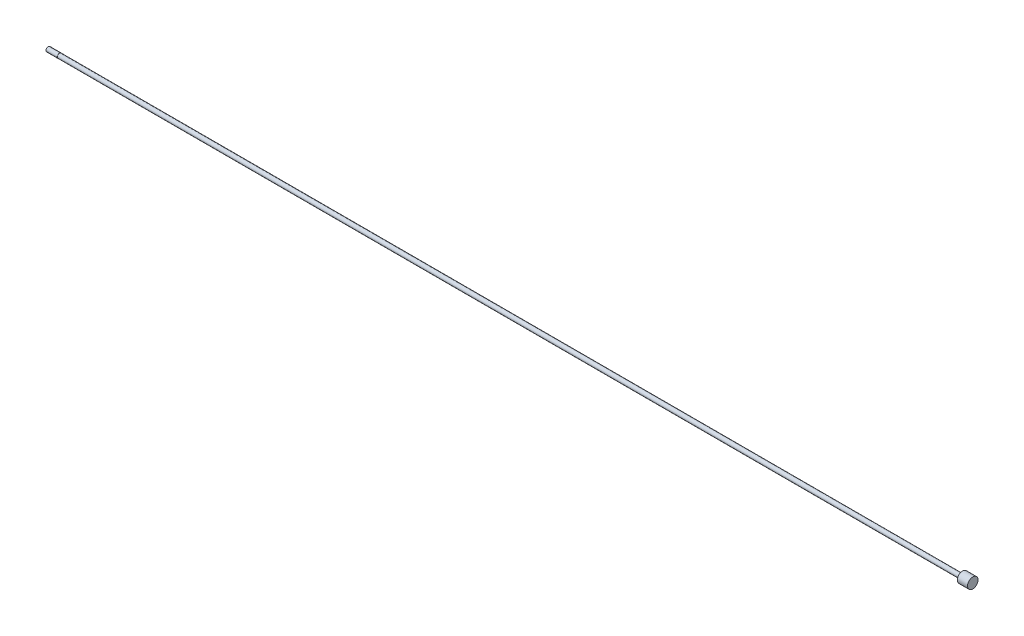
ISO-10303-21;
HEADER;
FILE_DESCRIPTION(('STEP AP214'),'2;1');
FILE_NAME('part.step','',(''),(''),'','','');
FILE_SCHEMA(('AUTOMOTIVE_DESIGN { 1 0 10303 214 1 1 1 1 }'));
ENDSEC;
DATA;
#1=APPLICATION_CONTEXT('core data for automotive mechanical design processes');
#2=APPLICATION_PROTOCOL_DEFINITION('international standard','automotive_design',2000,#1);
#3=PRODUCT_CONTEXT('',#1,'mechanical');
#4=PRODUCT('Part','Part','',(#3));
#5=PRODUCT_RELATED_PRODUCT_CATEGORY('part','',(#4));
#6=PRODUCT_DEFINITION_FORMATION('','',#4);
#7=PRODUCT_DEFINITION_CONTEXT('part definition',#1,'design');
#8=PRODUCT_DEFINITION('design','',#6,#7);
#9=PRODUCT_DEFINITION_SHAPE('','',#8);
#10=(LENGTH_UNIT() NAMED_UNIT(*) SI_UNIT(.MILLI.,.METRE.));
#11=(NAMED_UNIT(*) PLANE_ANGLE_UNIT() SI_UNIT($,.RADIAN.));
#12=(NAMED_UNIT(*) SI_UNIT($,.STERADIAN.) SOLID_ANGLE_UNIT());
#13=UNCERTAINTY_MEASURE_WITH_UNIT(LENGTH_MEASURE(1.E-05),#10,'distance_accuracy_value','');
#14=(GEOMETRIC_REPRESENTATION_CONTEXT(3) GLOBAL_UNCERTAINTY_ASSIGNED_CONTEXT((#13)) GLOBAL_UNIT_ASSIGNED_CONTEXT((#10,
#11,#12)) REPRESENTATION_CONTEXT('',''));
#15=CARTESIAN_POINT('',(0.,0.,0.));
#16=DIRECTION('',(0.,0.,1.));
#17=DIRECTION('',(1.,0.,0.));
#18=AXIS2_PLACEMENT_3D('',#15,#16,#17);
#19=CARTESIAN_POINT('',(980.9988,0.,0.));
#20=DIRECTION('',(-1.,0.,0.));
#21=DIRECTION('',(0.,0.,1.));
#22=AXIS2_PLACEMENT_3D('',#19,#20,#21);
#23=CYLINDRICAL_SURFACE('',#22,2.3749);
#24=CARTESIAN_POINT('',(0.,0.,0.));
#25=DIRECTION('',(-1.,0.,0.));
#26=DIRECTION('',(0.,0.,1.));
#27=AXIS2_PLACEMENT_3D('',#24,#25,#26);
#28=CIRCLE('',#27,2.3749);
#29=CARTESIAN_POINT('',(0.,0.,2.3749));
#30=VERTEX_POINT('',#29);
#31=EDGE_CURVE('E56',#30,#30,#28,.T.);
#32=ORIENTED_EDGE('',*,*,#31,.F.);
#33=EDGE_LOOP('',(#32));
#34=FACE_BOUND('',#33,.T.);
#35=CARTESIAN_POINT('',(969.9752,0.,0.));
#36=DIRECTION('',(-1.,0.,0.));
#37=DIRECTION('',(0.,0.,1.));
#38=AXIS2_PLACEMENT_3D('',#35,#36,#37);
#39=CIRCLE('',#38,2.3749);
#40=CARTESIAN_POINT('',(969.9752,0.,2.3749));
#41=VERTEX_POINT('',#40);
#42=EDGE_CURVE('E10',#41,#41,#39,.T.);
#43=ORIENTED_EDGE('',*,*,#42,.T.);
#44=EDGE_LOOP('',(#43));
#45=FACE_BOUND('',#44,.T.);
#46=ADVANCED_FACE('F34',(#34,#45),#23,.T.);
#47=CARTESIAN_POINT('',(969.9752,2.3749,0.));
#48=DIRECTION('',(1.,0.,0.));
#49=DIRECTION('',(0.,0.,-1.));
#50=AXIS2_PLACEMENT_3D('',#47,#48,#49);
#51=PLANE('',#50);
#52=ORIENTED_EDGE('',*,*,#42,.F.);
#53=EDGE_LOOP('',(#52));
#54=FACE_BOUND('',#53,.T.);
#55=CARTESIAN_POINT('',(969.9752,0.,0.));
#56=DIRECTION('',(-1.,0.,0.));
#57=DIRECTION('',(0.,0.,1.));
#58=AXIS2_PLACEMENT_3D('',#55,#56,#57);
#59=CIRCLE('',#58,5.61975);
#60=CARTESIAN_POINT('',(969.9752,0.,5.61975));
#61=VERTEX_POINT('',#60);
#62=EDGE_CURVE('E41',#61,#61,#59,.T.);
#63=ORIENTED_EDGE('',*,*,#62,.T.);
#64=EDGE_LOOP('',(#63));
#65=FACE_BOUND('',#64,.T.);
#66=ADVANCED_FACE('F77',(#54,#65),#51,.F.);
#67=CARTESIAN_POINT('',(980.9988,0.,0.));
#68=DIRECTION('',(-1.,0.,0.));
#69=DIRECTION('',(0.,0.,1.));
#70=AXIS2_PLACEMENT_3D('',#67,#68,#69);
#71=CYLINDRICAL_SURFACE('',#70,5.61975);
#72=ORIENTED_EDGE('',*,*,#62,.F.);
#73=EDGE_LOOP('',(#72));
#74=FACE_BOUND('',#73,.T.);
#75=CARTESIAN_POINT('',(980.9988,0.,0.));
#76=DIRECTION('',(-1.,0.,0.));
#77=DIRECTION('',(0.,0.,1.));
#78=AXIS2_PLACEMENT_3D('',#75,#76,#77);
#79=CIRCLE('',#78,5.61975);
#80=CARTESIAN_POINT('',(980.9988,0.,5.61975));
#81=VERTEX_POINT('',#80);
#82=EDGE_CURVE('E45',#81,#81,#79,.T.);
#83=ORIENTED_EDGE('',*,*,#82,.T.);
#84=EDGE_LOOP('',(#83));
#85=FACE_BOUND('',#84,.T.);
#86=ADVANCED_FACE('F81',(#74,#85),#71,.T.);
#87=CARTESIAN_POINT('',(980.9988,5.61975,0.));
#88=DIRECTION('',(-1.,0.,0.));
#89=DIRECTION('',(0.,0.,1.));
#90=AXIS2_PLACEMENT_3D('',#87,#88,#89);
#91=PLANE('',#90);
#92=ORIENTED_EDGE('',*,*,#82,.F.);
#93=EDGE_LOOP('',(#92));
#94=FACE_BOUND('',#93,.T.);
#95=ADVANCED_FACE('F86',(#94),#91,.F.);
#96=CARTESIAN_POINT('',(-0.254,2.667,0.));
#97=DIRECTION('',(1.,0.,0.));
#98=DIRECTION('',(0.,0.,-1.));
#99=AXIS2_PLACEMENT_3D('',#96,#97,#98);
#100=PLANE('',#99);
#101=CARTESIAN_POINT('',(-0.254,0.,0.));
#102=DIRECTION('',(-1.,0.,0.));
#103=DIRECTION('',(0.,0.,1.));
#104=AXIS2_PLACEMENT_3D('',#101,#102,#103);
#105=CIRCLE('',#104,2.159);
#106=CARTESIAN_POINT('',(-0.254,0.,2.159));
#107=VERTEX_POINT('',#106);
#108=EDGE_CURVE('E59',#107,#107,#105,.T.);
#109=ORIENTED_EDGE('',*,*,#108,.T.);
#110=EDGE_LOOP('',(#109));
#111=FACE_BOUND('',#110,.T.);
#112=CARTESIAN_POINT('',(-0.254,0.,0.));
#113=DIRECTION('',(1.,0.,0.));
#114=DIRECTION('',(0.,0.,-1.));
#115=AXIS2_PLACEMENT_3D('',#112,#113,#114);
#116=CIRCLE('',#115,2.413);
#117=CARTESIAN_POINT('',(-0.254,0.,-2.413));
#118=VERTEX_POINT('',#117);
#119=EDGE_CURVE('E37',#118,#118,#116,.T.);
#120=ORIENTED_EDGE('',*,*,#119,.T.);
#121=EDGE_LOOP('',(#120));
#122=FACE_BOUND('',#121,.T.);
#123=ADVANCED_FACE('F72',(#111,#122),#100,.T.);
#124=CARTESIAN_POINT('',(0.,2.159,0.));
#125=DIRECTION('',(-1.,0.,0.));
#126=DIRECTION('',(0.,0.,1.));
#127=AXIS2_PLACEMENT_3D('',#124,#125,#126);
#128=PLANE('',#127);
#129=CARTESIAN_POINT('',(0.,0.,0.));
#130=DIRECTION('',(-1.,0.,0.));
#131=DIRECTION('',(0.,0.,1.));
#132=AXIS2_PLACEMENT_3D('',#129,#130,#131);
#133=CIRCLE('',#132,2.159);
#134=CARTESIAN_POINT('',(0.,0.,2.159));
#135=VERTEX_POINT('',#134);
#136=EDGE_CURVE('E62',#135,#135,#133,.T.);
#137=ORIENTED_EDGE('',*,*,#136,.F.);
#138=EDGE_LOOP('',(#137));
#139=FACE_BOUND('',#138,.T.);
#140=ORIENTED_EDGE('',*,*,#31,.T.);
#141=EDGE_LOOP('',(#140));
#142=FACE_BOUND('',#141,.T.);
#143=ADVANCED_FACE('F69',(#139,#142),#128,.T.);
#144=CARTESIAN_POINT('',(0.,0.,0.));
#145=DIRECTION('',(-1.,0.,0.));
#146=DIRECTION('',(0.,0.,1.));
#147=AXIS2_PLACEMENT_3D('',#144,#145,#146);
#148=CYLINDRICAL_SURFACE('',#147,2.159);
#149=ORIENTED_EDGE('',*,*,#136,.T.);
#150=EDGE_LOOP('',(#149));
#151=FACE_BOUND('',#150,.T.);
#152=ORIENTED_EDGE('',*,*,#108,.F.);
#153=EDGE_LOOP('',(#152));
#154=FACE_BOUND('',#153,.T.);
#155=ADVANCED_FACE('F66',(#151,#154),#148,.T.);
#156=CARTESIAN_POINT('',(-12.7,0.,0.));
#157=DIRECTION('',(1.,0.,0.));
#158=DIRECTION('',(0.,0.,-1.));
#159=AXIS2_PLACEMENT_3D('',#156,#157,#158);
#160=PLANE('',#159);
#161=CARTESIAN_POINT('',(-12.7,0.,0.));
#162=DIRECTION('',(-1.,0.,0.));
#163=DIRECTION('',(0.,0.,1.));
#164=AXIS2_PLACEMENT_3D('',#161,#162,#163);
#165=CIRCLE('',#164,1.94056);
#166=CARTESIAN_POINT('',(-12.7,0.,1.94056));
#167=VERTEX_POINT('',#166);
#168=EDGE_CURVE('E50',#167,#167,#165,.T.);
#169=ORIENTED_EDGE('',*,*,#168,.T.);
#170=EDGE_LOOP('',(#169));
#171=FACE_BOUND('',#170,.T.);
#172=ADVANCED_FACE('F94',(#171),#160,.F.);
#173=CARTESIAN_POINT('',(-12.22756,0.,0.));
#174=DIRECTION('',(1.,0.,0.));
#175=DIRECTION('',(0.,0.,-1.));
#176=AXIS2_PLACEMENT_3D('',#173,#174,#175);
#177=CONICAL_SURFACE('',#176,2.413,0.785398163397449);
#178=ORIENTED_EDGE('',*,*,#168,.F.);
#179=EDGE_LOOP('',(#178));
#180=FACE_BOUND('',#179,.T.);
#181=CARTESIAN_POINT('',(-12.22756,0.,0.));
#182=DIRECTION('',(-1.,0.,0.));
#183=DIRECTION('',(0.,0.,1.));
#184=AXIS2_PLACEMENT_3D('',#181,#182,#183);
#185=CIRCLE('',#184,2.413);
#186=CARTESIAN_POINT('',(-12.22756,0.,2.413));
#187=VERTEX_POINT('',#186);
#188=EDGE_CURVE('E53',#187,#187,#185,.T.);
#189=ORIENTED_EDGE('',*,*,#188,.T.);
#190=EDGE_LOOP('',(#189));
#191=FACE_BOUND('',#190,.T.);
#192=ADVANCED_FACE('F97',(#180,#191),#177,.T.);
#193=CARTESIAN_POINT('',(0.,0.,0.));
#194=DIRECTION('',(-1.,0.,0.));
#195=DIRECTION('',(0.,0.,1.));
#196=AXIS2_PLACEMENT_3D('',#193,#194,#195);
#197=CYLINDRICAL_SURFACE('',#196,2.413);
#198=ORIENTED_EDGE('',*,*,#188,.F.);
#199=EDGE_LOOP('',(#198));
#200=FACE_BOUND('',#199,.T.);
#201=ORIENTED_EDGE('',*,*,#119,.F.);
#202=EDGE_LOOP('',(#201));
#203=FACE_BOUND('',#202,.T.);
#204=ADVANCED_FACE('F101',(#200,#203),#197,.T.);
#205=CLOSED_SHELL('',(#46,#66,#86,#95,#123,#143,#155,#172,#192,#204));
#206=MANIFOLD_SOLID_BREP('B2',#205);
#207=ADVANCED_BREP_SHAPE_REPRESENTATION('',(#18,#206),#14);
#208=SHAPE_DEFINITION_REPRESENTATION(#9,#207);
ENDSEC;
END-ISO-10303-21;
